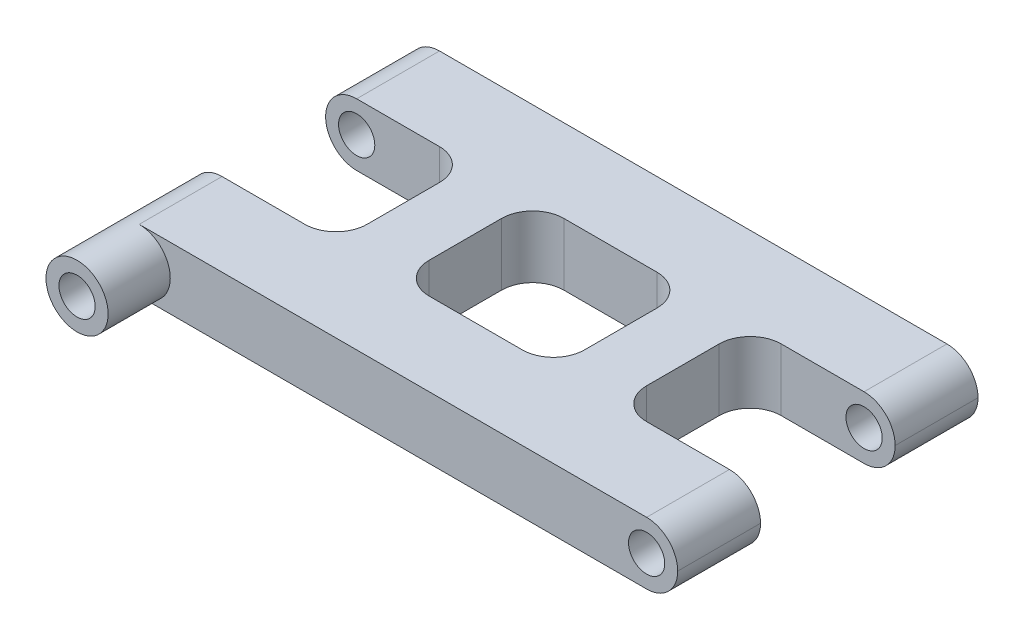
ISO-10303-21;
HEADER;
FILE_DESCRIPTION(('STEP AP214'),'2;1');
FILE_NAME('part.step','',(''),(''),'','','');
FILE_SCHEMA(('AUTOMOTIVE_DESIGN { 1 0 10303 214 1 1 1 1 }'));
ENDSEC;
DATA;
#1=APPLICATION_CONTEXT('core data for automotive mechanical design processes');
#2=APPLICATION_PROTOCOL_DEFINITION('international standard','automotive_design',2000,#1);
#3=PRODUCT_CONTEXT('',#1,'mechanical');
#4=PRODUCT('Part','Part','',(#3));
#5=PRODUCT_RELATED_PRODUCT_CATEGORY('part','',(#4));
#6=PRODUCT_DEFINITION_FORMATION('','',#4);
#7=PRODUCT_DEFINITION_CONTEXT('part definition',#1,'design');
#8=PRODUCT_DEFINITION('design','',#6,#7);
#9=PRODUCT_DEFINITION_SHAPE('','',#8);
#10=(LENGTH_UNIT() NAMED_UNIT(*) SI_UNIT(.MILLI.,.METRE.));
#11=(NAMED_UNIT(*) PLANE_ANGLE_UNIT() SI_UNIT($,.RADIAN.));
#12=(NAMED_UNIT(*) SI_UNIT($,.STERADIAN.) SOLID_ANGLE_UNIT());
#13=UNCERTAINTY_MEASURE_WITH_UNIT(LENGTH_MEASURE(1.E-05),#10,'distance_accuracy_value','');
#14=(GEOMETRIC_REPRESENTATION_CONTEXT(3) GLOBAL_UNCERTAINTY_ASSIGNED_CONTEXT((#13)) GLOBAL_UNIT_ASSIGNED_CONTEXT((#10,
#11,#12)) REPRESENTATION_CONTEXT('',''));
#15=CARTESIAN_POINT('',(0.,0.,0.));
#16=DIRECTION('',(0.,0.,1.));
#17=DIRECTION('',(1.,0.,0.));
#18=AXIS2_PLACEMENT_3D('',#15,#16,#17);
#19=CARTESIAN_POINT('',(0.,3.,0.));
#20=DIRECTION('',(0.,1.,0.));
#21=DIRECTION('',(0.,0.,1.));
#22=AXIS2_PLACEMENT_3D('',#19,#20,#21);
#23=PLANE('',#22);
#24=DIRECTION('',(0.,0.,-1.));
#25=VECTOR('',#24,1.);
#26=CARTESIAN_POINT('',(41.,3.,-21.));
#27=LINE('',#26,#25);
#28=CARTESIAN_POINT('',(41.,3.,-11.));
#29=VERTEX_POINT('',#28);
#30=CARTESIAN_POINT('',(41.,3.,-18.));
#31=VERTEX_POINT('',#30);
#32=EDGE_CURVE('E291',#29,#31,#27,.T.);
#33=ORIENTED_EDGE('',*,*,#32,.T.);
#34=CARTESIAN_POINT('',(44.,3.,-18.));
#35=DIRECTION('',(0.,1.,0.));
#36=DIRECTION('',(0.,0.,1.));
#37=AXIS2_PLACEMENT_3D('',#34,#35,#36);
#38=CIRCLE('',#37,3.);
#39=CARTESIAN_POINT('',(44.,3.,-21.));
#40=VERTEX_POINT('',#39);
#41=EDGE_CURVE('E60',#31,#40,#38,.F.);
#42=ORIENTED_EDGE('',*,*,#41,.T.);
#43=DIRECTION('',(1.,0.,0.));
#44=VECTOR('',#43,1.);
#45=CARTESIAN_POINT('',(55.,3.,-21.));
#46=LINE('',#45,#44);
#47=CARTESIAN_POINT('',(52.,3.,-21.));
#48=VERTEX_POINT('',#47);
#49=EDGE_CURVE('E293',#40,#48,#46,.T.);
#50=ORIENTED_EDGE('',*,*,#49,.T.);
#51=DIRECTION('',(0.,0.,-1.));
#52=VECTOR('',#51,1.);
#53=CARTESIAN_POINT('',(52.,3.,-29.));
#54=LINE('',#53,#52);
#55=CARTESIAN_POINT('',(52.,3.,-29.));
#56=VERTEX_POINT('',#55);
#57=EDGE_CURVE('E326',#48,#56,#54,.T.);
#58=ORIENTED_EDGE('',*,*,#57,.T.);
#59=DIRECTION('',(-1.,0.,0.));
#60=VECTOR('',#59,1.);
#61=CARTESIAN_POINT('',(0.,3.,-29.));
#62=LINE('',#61,#60);
#63=CARTESIAN_POINT('',(2.99999999999999,3.,-29.));
#64=VERTEX_POINT('',#63);
#65=EDGE_CURVE('E295',#56,#64,#62,.T.);
#66=ORIENTED_EDGE('',*,*,#65,.T.);
#67=DIRECTION('',(0.,0.,1.));
#68=VECTOR('',#67,1.);
#69=CARTESIAN_POINT('',(2.99999999999999,3.,-21.));
#70=LINE('',#69,#68);
#71=CARTESIAN_POINT('',(3.,3.,-21.));
#72=VERTEX_POINT('',#71);
#73=EDGE_CURVE('E244',#64,#72,#70,.T.);
#74=ORIENTED_EDGE('',*,*,#73,.T.);
#75=DIRECTION('',(1.,0.,0.));
#76=VECTOR('',#75,1.);
#77=CARTESIAN_POINT('',(14.,3.,-21.));
#78=LINE('',#77,#76);
#79=CARTESIAN_POINT('',(11.,3.,-21.));
#80=VERTEX_POINT('',#79);
#81=EDGE_CURVE('E298',#72,#80,#78,.T.);
#82=ORIENTED_EDGE('',*,*,#81,.T.);
#83=CARTESIAN_POINT('',(11.,3.,-18.));
#84=DIRECTION('',(0.,1.,0.));
#85=DIRECTION('',(0.,0.,1.));
#86=AXIS2_PLACEMENT_3D('',#83,#84,#85);
#87=CIRCLE('',#86,3.);
#88=CARTESIAN_POINT('',(14.,3.,-18.));
#89=VERTEX_POINT('',#88);
#90=EDGE_CURVE('E418',#80,#89,#87,.F.);
#91=ORIENTED_EDGE('',*,*,#90,.T.);
#92=DIRECTION('',(0.,0.,1.));
#93=VECTOR('',#92,1.);
#94=CARTESIAN_POINT('',(14.,3.,-8.));
#95=LINE('',#94,#93);
#96=CARTESIAN_POINT('',(14.,3.,-11.));
#97=VERTEX_POINT('',#96);
#98=EDGE_CURVE('E301',#89,#97,#95,.T.);
#99=ORIENTED_EDGE('',*,*,#98,.T.);
#100=CARTESIAN_POINT('',(11.,3.,-11.));
#101=DIRECTION('',(0.,1.,0.));
#102=DIRECTION('',(0.,0.,1.));
#103=AXIS2_PLACEMENT_3D('',#100,#101,#102);
#104=CIRCLE('',#103,3.);
#105=CARTESIAN_POINT('',(11.,3.,-8.));
#106=VERTEX_POINT('',#105);
#107=EDGE_CURVE('E426',#97,#106,#104,.F.);
#108=ORIENTED_EDGE('',*,*,#107,.T.);
#109=DIRECTION('',(-1.,0.,0.));
#110=VECTOR('',#109,1.);
#111=CARTESIAN_POINT('',(0.,3.,-8.));
#112=LINE('',#111,#110);
#113=CARTESIAN_POINT('',(3.,3.,-8.));
#114=VERTEX_POINT('',#113);
#115=EDGE_CURVE('E239',#106,#114,#112,.T.);
#116=ORIENTED_EDGE('',*,*,#115,.T.);
#117=DIRECTION('',(0.,0.,1.));
#118=VECTOR('',#117,1.);
#119=CARTESIAN_POINT('',(3.,3.,0.));
#120=LINE('',#119,#118);
#121=CARTESIAN_POINT('',(3.00000000000007,3.00000000000041,0.));
#122=VERTEX_POINT('',#121);
#123=EDGE_CURVE('E236',#114,#122,#120,.T.);
#124=ORIENTED_EDGE('',*,*,#123,.T.);
#125=DIRECTION('',(1.,0.,0.));
#126=VECTOR('',#125,1.);
#127=CARTESIAN_POINT('',(0.,3.,0.));
#128=LINE('',#127,#126);
#129=CARTESIAN_POINT('',(52.,3.,0.));
#130=VERTEX_POINT('',#129);
#131=EDGE_CURVE('E222',#122,#130,#128,.T.);
#132=ORIENTED_EDGE('',*,*,#131,.T.);
#133=DIRECTION('',(0.,0.,-1.));
#134=VECTOR('',#133,1.);
#135=CARTESIAN_POINT('',(52.,3.,-8.));
#136=LINE('',#135,#134);
#137=CARTESIAN_POINT('',(52.,3.,-8.));
#138=VERTEX_POINT('',#137);
#139=EDGE_CURVE('E243',#130,#138,#136,.T.);
#140=ORIENTED_EDGE('',*,*,#139,.T.);
#141=DIRECTION('',(-1.,0.,0.));
#142=VECTOR('',#141,1.);
#143=CARTESIAN_POINT('',(55.,3.,-8.));
#144=LINE('',#143,#142);
#145=CARTESIAN_POINT('',(44.,3.,-8.));
#146=VERTEX_POINT('',#145);
#147=EDGE_CURVE('E232',#138,#146,#144,.T.);
#148=ORIENTED_EDGE('',*,*,#147,.T.);
#149=CARTESIAN_POINT('',(44.,3.,-11.));
#150=DIRECTION('',(0.,1.,0.));
#151=DIRECTION('',(0.,0.,1.));
#152=AXIS2_PLACEMENT_3D('',#149,#150,#151);
#153=CIRCLE('',#152,3.);
#154=EDGE_CURVE('E438',#146,#29,#153,.F.);
#155=ORIENTED_EDGE('',*,*,#154,.T.);
#156=EDGE_LOOP('',(#33,#42,#50,#58,#66,#74,#82,#91,#99,#108,#116,#124,#132,#140,#148,#155));
#157=FACE_BOUND('',#156,.T.);
#158=DIRECTION('',(1.,0.,0.));
#159=VECTOR('',#158,1.);
#160=CARTESIAN_POINT('',(20.,3.,-8.));
#161=LINE('',#160,#159);
#162=CARTESIAN_POINT('',(23.,3.,-8.));
#163=VERTEX_POINT('',#162);
#164=CARTESIAN_POINT('',(32.,3.,-8.));
#165=VERTEX_POINT('',#164);
#166=EDGE_CURVE('E266',#163,#165,#161,.T.);
#167=ORIENTED_EDGE('',*,*,#166,.F.);
#168=CARTESIAN_POINT('',(23.,3.,-11.));
#169=DIRECTION('',(0.,1.,0.));
#170=DIRECTION('',(0.,0.,1.));
#171=AXIS2_PLACEMENT_3D('',#168,#169,#170);
#172=CIRCLE('',#171,3.);
#173=CARTESIAN_POINT('',(20.,3.,-11.));
#174=VERTEX_POINT('',#173);
#175=EDGE_CURVE('E434',#163,#174,#172,.F.);
#176=ORIENTED_EDGE('',*,*,#175,.T.);
#177=DIRECTION('',(0.,0.,1.));
#178=VECTOR('',#177,1.);
#179=CARTESIAN_POINT('',(20.,3.,-8.));
#180=LINE('',#179,#178);
#181=CARTESIAN_POINT('',(20.,3.,-18.));
#182=VERTEX_POINT('',#181);
#183=EDGE_CURVE('E263',#182,#174,#180,.T.);
#184=ORIENTED_EDGE('',*,*,#183,.F.);
#185=CARTESIAN_POINT('',(23.,3.,-18.));
#186=DIRECTION('',(0.,1.,0.));
#187=DIRECTION('',(0.,0.,1.));
#188=AXIS2_PLACEMENT_3D('',#185,#186,#187);
#189=CIRCLE('',#188,3.);
#190=CARTESIAN_POINT('',(23.,3.,-21.));
#191=VERTEX_POINT('',#190);
#192=EDGE_CURVE('E11',#182,#191,#189,.F.);
#193=ORIENTED_EDGE('',*,*,#192,.T.);
#194=DIRECTION('',(-1.,0.,0.));
#195=VECTOR('',#194,1.);
#196=CARTESIAN_POINT('',(20.,3.,-21.));
#197=LINE('',#196,#195);
#198=CARTESIAN_POINT('',(32.,3.,-21.));
#199=VERTEX_POINT('',#198);
#200=EDGE_CURVE('E273',#199,#191,#197,.T.);
#201=ORIENTED_EDGE('',*,*,#200,.F.);
#202=CARTESIAN_POINT('',(32.,3.,-18.));
#203=DIRECTION('',(0.,1.,0.));
#204=DIRECTION('',(0.,0.,1.));
#205=AXIS2_PLACEMENT_3D('',#202,#203,#204);
#206=CIRCLE('',#205,3.);
#207=CARTESIAN_POINT('',(35.,3.,-18.));
#208=VERTEX_POINT('',#207);
#209=EDGE_CURVE('E422',#199,#208,#206,.F.);
#210=ORIENTED_EDGE('',*,*,#209,.T.);
#211=DIRECTION('',(0.,0.,-1.));
#212=VECTOR('',#211,1.);
#213=CARTESIAN_POINT('',(35.,3.,-8.));
#214=LINE('',#213,#212);
#215=CARTESIAN_POINT('',(35.,3.,-11.));
#216=VERTEX_POINT('',#215);
#217=EDGE_CURVE('E270',#216,#208,#214,.T.);
#218=ORIENTED_EDGE('',*,*,#217,.F.);
#219=CARTESIAN_POINT('',(32.,3.,-11.));
#220=DIRECTION('',(0.,1.,0.));
#221=DIRECTION('',(0.,0.,1.));
#222=AXIS2_PLACEMENT_3D('',#219,#220,#221);
#223=CIRCLE('',#222,3.);
#224=EDGE_CURVE('E430',#216,#165,#223,.F.);
#225=ORIENTED_EDGE('',*,*,#224,.T.);
#226=EDGE_LOOP('',(#167,#176,#184,#193,#201,#210,#218,#225));
#227=FACE_BOUND('',#226,.T.);
#228=ADVANCED_FACE('F37',(#157,#227),#23,.T.);
#229=CARTESIAN_POINT('',(0.,-3.,0.));
#230=DIRECTION('',(0.,1.,0.));
#231=DIRECTION('',(0.,0.,1.));
#232=AXIS2_PLACEMENT_3D('',#229,#230,#231);
#233=PLANE('',#232);
#234=DIRECTION('',(-1.,0.,0.));
#235=VECTOR('',#234,1.);
#236=CARTESIAN_POINT('',(0.,-3.,-29.));
#237=LINE('',#236,#235);
#238=CARTESIAN_POINT('',(52.,-3.,-29.));
#239=VERTEX_POINT('',#238);
#240=CARTESIAN_POINT('',(2.99999999999999,-3.,-29.));
#241=VERTEX_POINT('',#240);
#242=EDGE_CURVE('E314',#239,#241,#237,.T.);
#243=ORIENTED_EDGE('',*,*,#242,.F.);
#244=DIRECTION('',(0.,0.,-1.));
#245=VECTOR('',#244,1.);
#246=CARTESIAN_POINT('',(52.,-3.,0.));
#247=LINE('',#246,#245);
#248=CARTESIAN_POINT('',(52.,-3.,-21.));
#249=VERTEX_POINT('',#248);
#250=EDGE_CURVE('E349',#239,#249,#247,.F.);
#251=ORIENTED_EDGE('',*,*,#250,.T.);
#252=DIRECTION('',(1.,0.,0.));
#253=VECTOR('',#252,1.);
#254=CARTESIAN_POINT('',(55.,-3.,-21.));
#255=LINE('',#254,#253);
#256=CARTESIAN_POINT('',(44.,-3.,-21.));
#257=VERTEX_POINT('',#256);
#258=EDGE_CURVE('E312',#257,#249,#255,.T.);
#259=ORIENTED_EDGE('',*,*,#258,.F.);
#260=CARTESIAN_POINT('',(44.,-3.,-18.));
#261=DIRECTION('',(0.,1.,0.));
#262=DIRECTION('',(0.,0.,1.));
#263=AXIS2_PLACEMENT_3D('',#260,#261,#262);
#264=CIRCLE('',#263,3.);
#265=CARTESIAN_POINT('',(41.,-3.,-18.));
#266=VERTEX_POINT('',#265);
#267=EDGE_CURVE('E52',#257,#266,#264,.T.);
#268=ORIENTED_EDGE('',*,*,#267,.T.);
#269=DIRECTION('',(0.,0.,-1.));
#270=VECTOR('',#269,1.);
#271=CARTESIAN_POINT('',(41.,-3.,-21.));
#272=LINE('',#271,#270);
#273=CARTESIAN_POINT('',(41.,-3.,-11.));
#274=VERTEX_POINT('',#273);
#275=EDGE_CURVE('E309',#274,#266,#272,.T.);
#276=ORIENTED_EDGE('',*,*,#275,.F.);
#277=CARTESIAN_POINT('',(44.,-3.,-11.));
#278=DIRECTION('',(0.,1.,0.));
#279=DIRECTION('',(0.,0.,1.));
#280=AXIS2_PLACEMENT_3D('',#277,#278,#279);
#281=CIRCLE('',#280,3.);
#282=CARTESIAN_POINT('',(44.,-3.,-8.));
#283=VERTEX_POINT('',#282);
#284=EDGE_CURVE('E436',#274,#283,#281,.T.);
#285=ORIENTED_EDGE('',*,*,#284,.T.);
#286=DIRECTION('',(-1.,0.,0.));
#287=VECTOR('',#286,1.);
#288=CARTESIAN_POINT('',(55.,-3.,-8.));
#289=LINE('',#288,#287);
#290=CARTESIAN_POINT('',(52.,-3.,-8.));
#291=VERTEX_POINT('',#290);
#292=EDGE_CURVE('E306',#291,#283,#289,.T.);
#293=ORIENTED_EDGE('',*,*,#292,.F.);
#294=DIRECTION('',(0.,0.,-1.));
#295=VECTOR('',#294,1.);
#296=CARTESIAN_POINT('',(52.,-3.,0.));
#297=LINE('',#296,#295);
#298=CARTESIAN_POINT('',(52.,-3.,0.));
#299=VERTEX_POINT('',#298);
#300=EDGE_CURVE('E346',#291,#299,#297,.F.);
#301=ORIENTED_EDGE('',*,*,#300,.T.);
#302=DIRECTION('',(1.,0.,0.));
#303=VECTOR('',#302,1.);
#304=CARTESIAN_POINT('',(0.,-3.,0.));
#305=LINE('',#304,#303);
#306=CARTESIAN_POINT('',(3.,-3.,0.));
#307=VERTEX_POINT('',#306);
#308=EDGE_CURVE('E276',#307,#299,#305,.T.);
#309=ORIENTED_EDGE('',*,*,#308,.F.);
#310=DIRECTION('',(0.,0.,1.));
#311=VECTOR('',#310,1.);
#312=CARTESIAN_POINT('',(3.,-3.,0.));
#313=LINE('',#312,#311);
#314=CARTESIAN_POINT('',(3.,-3.,-8.));
#315=VERTEX_POINT('',#314);
#316=EDGE_CURVE('E251',#307,#315,#313,.F.);
#317=ORIENTED_EDGE('',*,*,#316,.T.);
#318=DIRECTION('',(-1.,0.,0.));
#319=VECTOR('',#318,1.);
#320=CARTESIAN_POINT('',(0.,-3.,-8.));
#321=LINE('',#320,#319);
#322=CARTESIAN_POINT('',(11.,-3.,-8.));
#323=VERTEX_POINT('',#322);
#324=EDGE_CURVE('E233',#323,#315,#321,.T.);
#325=ORIENTED_EDGE('',*,*,#324,.F.);
#326=CARTESIAN_POINT('',(11.,-3.,-11.));
#327=DIRECTION('',(0.,1.,0.));
#328=DIRECTION('',(0.,0.,1.));
#329=AXIS2_PLACEMENT_3D('',#326,#327,#328);
#330=CIRCLE('',#329,3.);
#331=CARTESIAN_POINT('',(14.,-3.,-11.));
#332=VERTEX_POINT('',#331);
#333=EDGE_CURVE('E424',#323,#332,#330,.T.);
#334=ORIENTED_EDGE('',*,*,#333,.T.);
#335=DIRECTION('',(0.,0.,1.));
#336=VECTOR('',#335,1.);
#337=CARTESIAN_POINT('',(14.,-3.,-8.));
#338=LINE('',#337,#336);
#339=CARTESIAN_POINT('',(14.,-3.,-18.));
#340=VERTEX_POINT('',#339);
#341=EDGE_CURVE('E320',#340,#332,#338,.T.);
#342=ORIENTED_EDGE('',*,*,#341,.F.);
#343=CARTESIAN_POINT('',(11.,-3.,-18.));
#344=DIRECTION('',(0.,1.,0.));
#345=DIRECTION('',(0.,0.,1.));
#346=AXIS2_PLACEMENT_3D('',#343,#344,#345);
#347=CIRCLE('',#346,3.);
#348=CARTESIAN_POINT('',(11.,-3.,-21.));
#349=VERTEX_POINT('',#348);
#350=EDGE_CURVE('E416',#340,#349,#347,.T.);
#351=ORIENTED_EDGE('',*,*,#350,.T.);
#352=DIRECTION('',(1.,0.,0.));
#353=VECTOR('',#352,1.);
#354=CARTESIAN_POINT('',(14.,-3.,-21.));
#355=LINE('',#354,#353);
#356=CARTESIAN_POINT('',(3.,-3.,-21.));
#357=VERTEX_POINT('',#356);
#358=EDGE_CURVE('E317',#357,#349,#355,.T.);
#359=ORIENTED_EDGE('',*,*,#358,.F.);
#360=DIRECTION('',(0.,0.,1.));
#361=VECTOR('',#360,1.);
#362=CARTESIAN_POINT('',(2.99999999999999,-3.,0.));
#363=LINE('',#362,#361);
#364=EDGE_CURVE('E342',#357,#241,#363,.F.);
#365=ORIENTED_EDGE('',*,*,#364,.T.);
#366=EDGE_LOOP('',(#243,#251,#259,#268,#276,#285,#293,#301,#309,#317,#325,#334,#342,#351,#359,#365));
#367=FACE_BOUND('',#366,.T.);
#368=DIRECTION('',(-1.,0.,0.));
#369=VECTOR('',#368,1.);
#370=CARTESIAN_POINT('',(20.,-3.,-21.));
#371=LINE('',#370,#369);
#372=CARTESIAN_POINT('',(32.,-3.,-21.));
#373=VERTEX_POINT('',#372);
#374=CARTESIAN_POINT('',(23.,-3.,-21.));
#375=VERTEX_POINT('',#374);
#376=EDGE_CURVE('E267',#373,#375,#371,.T.);
#377=ORIENTED_EDGE('',*,*,#376,.T.);
#378=CARTESIAN_POINT('',(23.,-3.,-18.));
#379=DIRECTION('',(0.,1.,0.));
#380=DIRECTION('',(0.,0.,1.));
#381=AXIS2_PLACEMENT_3D('',#378,#379,#380);
#382=CIRCLE('',#381,3.);
#383=CARTESIAN_POINT('',(20.,-3.,-18.));
#384=VERTEX_POINT('',#383);
#385=EDGE_CURVE('E45',#375,#384,#382,.T.);
#386=ORIENTED_EDGE('',*,*,#385,.T.);
#387=DIRECTION('',(0.,0.,1.));
#388=VECTOR('',#387,1.);
#389=CARTESIAN_POINT('',(20.,-3.,-8.));
#390=LINE('',#389,#388);
#391=CARTESIAN_POINT('',(20.,-3.,-11.));
#392=VERTEX_POINT('',#391);
#393=EDGE_CURVE('E277',#384,#392,#390,.T.);
#394=ORIENTED_EDGE('',*,*,#393,.T.);
#395=CARTESIAN_POINT('',(23.,-3.,-11.));
#396=DIRECTION('',(0.,1.,0.));
#397=DIRECTION('',(0.,0.,1.));
#398=AXIS2_PLACEMENT_3D('',#395,#396,#397);
#399=CIRCLE('',#398,3.);
#400=CARTESIAN_POINT('',(23.,-3.,-8.));
#401=VERTEX_POINT('',#400);
#402=EDGE_CURVE('E432',#392,#401,#399,.T.);
#403=ORIENTED_EDGE('',*,*,#402,.T.);
#404=DIRECTION('',(1.,0.,0.));
#405=VECTOR('',#404,1.);
#406=CARTESIAN_POINT('',(20.,-3.,-8.));
#407=LINE('',#406,#405);
#408=CARTESIAN_POINT('',(32.,-3.,-8.));
#409=VERTEX_POINT('',#408);
#410=EDGE_CURVE('E280',#401,#409,#407,.T.);
#411=ORIENTED_EDGE('',*,*,#410,.T.);
#412=CARTESIAN_POINT('',(32.,-3.,-11.));
#413=DIRECTION('',(0.,1.,0.));
#414=DIRECTION('',(0.,0.,1.));
#415=AXIS2_PLACEMENT_3D('',#412,#413,#414);
#416=CIRCLE('',#415,3.);
#417=CARTESIAN_POINT('',(35.,-3.,-11.));
#418=VERTEX_POINT('',#417);
#419=EDGE_CURVE('E428',#409,#418,#416,.T.);
#420=ORIENTED_EDGE('',*,*,#419,.T.);
#421=DIRECTION('',(0.,0.,-1.));
#422=VECTOR('',#421,1.);
#423=CARTESIAN_POINT('',(35.,-3.,-8.));
#424=LINE('',#423,#422);
#425=CARTESIAN_POINT('',(35.,-3.,-18.));
#426=VERTEX_POINT('',#425);
#427=EDGE_CURVE('E284',#418,#426,#424,.T.);
#428=ORIENTED_EDGE('',*,*,#427,.T.);
#429=CARTESIAN_POINT('',(32.,-3.,-18.));
#430=DIRECTION('',(0.,1.,0.));
#431=DIRECTION('',(0.,0.,1.));
#432=AXIS2_PLACEMENT_3D('',#429,#430,#431);
#433=CIRCLE('',#432,3.);
#434=EDGE_CURVE('E420',#426,#373,#433,.T.);
#435=ORIENTED_EDGE('',*,*,#434,.T.);
#436=EDGE_LOOP('',(#377,#386,#394,#403,#411,#420,#428,#435));
#437=FACE_BOUND('',#436,.T.);
#438=ADVANCED_FACE('F443',(#367,#437),#233,.F.);
#439=CARTESIAN_POINT('',(0.,3.,0.));
#440=DIRECTION('',(0.,0.,-1.));
#441=DIRECTION('',(-1.,0.,0.));
#442=AXIS2_PLACEMENT_3D('',#439,#440,#441);
#443=PLANE('',#442);
#444=CARTESIAN_POINT('',(52.,0.,0.));
#445=DIRECTION('',(0.,0.,1.));
#446=DIRECTION('',(1.,0.,0.));
#447=AXIS2_PLACEMENT_3D('',#444,#445,#446);
#448=CIRCLE('',#447,1.75);
#449=CARTESIAN_POINT('',(53.75,0.,0.));
#450=VERTEX_POINT('',#449);
#451=EDGE_CURVE('E926',#450,#450,#448,.T.);
#452=ORIENTED_EDGE('',*,*,#451,.F.);
#453=EDGE_LOOP('',(#452));
#454=FACE_BOUND('',#453,.T.);
#455=CARTESIAN_POINT('',(3.00000000000007,4.1286418728248E-13,0.));
#456=DIRECTION('',(0.,0.,1.));
#457=DIRECTION('',(1.,0.,0.));
#458=AXIS2_PLACEMENT_3D('',#455,#456,#457);
#459=CIRCLE('',#458,3.);
#460=EDGE_CURVE('E227',#307,#122,#459,.T.);
#461=ORIENTED_EDGE('',*,*,#460,.F.);
#462=ORIENTED_EDGE('',*,*,#308,.T.);
#463=CARTESIAN_POINT('',(52.,0.,0.));
#464=DIRECTION('',(0.,0.,-1.));
#465=DIRECTION('',(-1.,0.,0.));
#466=AXIS2_PLACEMENT_3D('',#463,#464,#465);
#467=CIRCLE('',#466,3.);
#468=CARTESIAN_POINT('',(55.,0.,0.));
#469=VERTEX_POINT('',#468);
#470=EDGE_CURVE('E357',#299,#469,#467,.F.);
#471=ORIENTED_EDGE('',*,*,#470,.T.);
#472=CARTESIAN_POINT('',(52.,0.,0.));
#473=DIRECTION('',(0.,0.,-1.));
#474=DIRECTION('',(-1.,0.,0.));
#475=AXIS2_PLACEMENT_3D('',#472,#473,#474);
#476=CIRCLE('',#475,3.);
#477=EDGE_CURVE('E230',#469,#130,#476,.F.);
#478=ORIENTED_EDGE('',*,*,#477,.T.);
#479=ORIENTED_EDGE('',*,*,#131,.F.);
#480=EDGE_LOOP('',(#461,#462,#471,#478,#479));
#481=FACE_BOUND('',#480,.T.);
#482=ADVANCED_FACE('F224',(#454,#481),#443,.F.);
#483=CARTESIAN_POINT('',(55.,3.,-8.));
#484=DIRECTION('',(0.,0.,1.));
#485=DIRECTION('',(1.,0.,0.));
#486=AXIS2_PLACEMENT_3D('',#483,#484,#485);
#487=PLANE('',#486);
#488=CARTESIAN_POINT('',(52.,0.,-8.));
#489=DIRECTION('',(0.,0.,1.));
#490=DIRECTION('',(1.,0.,0.));
#491=AXIS2_PLACEMENT_3D('',#488,#489,#490);
#492=CIRCLE('',#491,1.75);
#493=CARTESIAN_POINT('',(53.75,0.,-8.));
#494=VERTEX_POINT('',#493);
#495=EDGE_CURVE('E919',#494,#494,#492,.T.);
#496=ORIENTED_EDGE('',*,*,#495,.T.);
#497=EDGE_LOOP('',(#496));
#498=FACE_BOUND('',#497,.T.);
#499=ORIENTED_EDGE('',*,*,#292,.T.);
#500=DIRECTION('',(0.,-1.,0.));
#501=VECTOR('',#500,1.);
#502=CARTESIAN_POINT('',(44.,3.,-8.));
#503=LINE('',#502,#501);
#504=EDGE_CURVE('E412',#283,#146,#503,.F.);
#505=ORIENTED_EDGE('',*,*,#504,.T.);
#506=ORIENTED_EDGE('',*,*,#147,.F.);
#507=CARTESIAN_POINT('',(52.,0.,-8.));
#508=DIRECTION('',(0.,0.,1.));
#509=DIRECTION('',(1.,0.,0.));
#510=AXIS2_PLACEMENT_3D('',#507,#508,#509);
#511=CIRCLE('',#510,3.);
#512=CARTESIAN_POINT('',(55.,0.,-8.));
#513=VERTEX_POINT('',#512);
#514=EDGE_CURVE('E352',#138,#513,#511,.F.);
#515=ORIENTED_EDGE('',*,*,#514,.T.);
#516=CARTESIAN_POINT('',(52.,0.,-8.));
#517=DIRECTION('',(0.,0.,1.));
#518=DIRECTION('',(1.,0.,0.));
#519=AXIS2_PLACEMENT_3D('',#516,#517,#518);
#520=CIRCLE('',#519,3.);
#521=EDGE_CURVE('E354',#513,#291,#520,.F.);
#522=ORIENTED_EDGE('',*,*,#521,.T.);
#523=EDGE_LOOP('',(#499,#505,#506,#515,#522));
#524=FACE_BOUND('',#523,.T.);
#525=ADVANCED_FACE('F523',(#498,#524),#487,.F.);
#526=CARTESIAN_POINT('',(41.,3.,-21.));
#527=DIRECTION('',(-1.,0.,0.));
#528=DIRECTION('',(0.,0.,1.));
#529=AXIS2_PLACEMENT_3D('',#526,#527,#528);
#530=PLANE('',#529);
#531=ORIENTED_EDGE('',*,*,#32,.F.);
#532=DIRECTION('',(0.,-1.,0.));
#533=VECTOR('',#532,1.);
#534=CARTESIAN_POINT('',(41.,-3.,-11.));
#535=LINE('',#534,#533);
#536=EDGE_CURVE('E409',#29,#274,#535,.T.);
#537=ORIENTED_EDGE('',*,*,#536,.T.);
#538=ORIENTED_EDGE('',*,*,#275,.T.);
#539=DIRECTION('',(0.,-1.,0.));
#540=VECTOR('',#539,1.);
#541=CARTESIAN_POINT('',(41.,3.,-18.));
#542=LINE('',#541,#540);
#543=EDGE_CURVE('E407',#266,#31,#542,.F.);
#544=ORIENTED_EDGE('',*,*,#543,.T.);
#545=EDGE_LOOP('',(#531,#537,#538,#544));
#546=FACE_BOUND('',#545,.T.);
#547=ADVANCED_FACE('F519',(#546),#530,.F.);
#548=CARTESIAN_POINT('',(55.,3.,-21.));
#549=DIRECTION('',(0.,0.,-1.));
#550=DIRECTION('',(-1.,0.,0.));
#551=AXIS2_PLACEMENT_3D('',#548,#549,#550);
#552=PLANE('',#551);
#553=CARTESIAN_POINT('',(52.,0.,-21.));
#554=DIRECTION('',(0.,0.,-1.));
#555=DIRECTION('',(-1.,0.,0.));
#556=AXIS2_PLACEMENT_3D('',#553,#554,#555);
#557=CIRCLE('',#556,1.75);
#558=CARTESIAN_POINT('',(50.25,0.,-21.));
#559=VERTEX_POINT('',#558);
#560=EDGE_CURVE('E922',#559,#559,#557,.T.);
#561=ORIENTED_EDGE('',*,*,#560,.T.);
#562=EDGE_LOOP('',(#561));
#563=FACE_BOUND('',#562,.T.);
#564=ORIENTED_EDGE('',*,*,#49,.F.);
#565=DIRECTION('',(0.,-1.,0.));
#566=VECTOR('',#565,1.);
#567=CARTESIAN_POINT('',(44.,-3.,-21.));
#568=LINE('',#567,#566);
#569=EDGE_CURVE('E414',#40,#257,#568,.T.);
#570=ORIENTED_EDGE('',*,*,#569,.T.);
#571=ORIENTED_EDGE('',*,*,#258,.T.);
#572=CARTESIAN_POINT('',(52.,0.,-21.));
#573=DIRECTION('',(0.,0.,-1.));
#574=DIRECTION('',(-1.,0.,0.));
#575=AXIS2_PLACEMENT_3D('',#572,#573,#574);
#576=CIRCLE('',#575,3.);
#577=CARTESIAN_POINT('',(55.,0.,-21.));
#578=VERTEX_POINT('',#577);
#579=EDGE_CURVE('E337',#249,#578,#576,.F.);
#580=ORIENTED_EDGE('',*,*,#579,.T.);
#581=CARTESIAN_POINT('',(52.,0.,-21.));
#582=DIRECTION('',(0.,0.,-1.));
#583=DIRECTION('',(-1.,0.,0.));
#584=AXIS2_PLACEMENT_3D('',#581,#582,#583);
#585=CIRCLE('',#584,3.);
#586=EDGE_CURVE('E339',#578,#48,#585,.F.);
#587=ORIENTED_EDGE('',*,*,#586,.T.);
#588=EDGE_LOOP('',(#564,#570,#571,#580,#587));
#589=FACE_BOUND('',#588,.T.);
#590=ADVANCED_FACE('F515',(#563,#589),#552,.F.);
#591=CARTESIAN_POINT('',(0.,3.,-29.));
#592=DIRECTION('',(0.,0.,1.));
#593=DIRECTION('',(1.,0.,0.));
#594=AXIS2_PLACEMENT_3D('',#591,#592,#593);
#595=PLANE('',#594);
#596=CARTESIAN_POINT('',(52.,0.,-29.));
#597=DIRECTION('',(0.,0.,1.));
#598=DIRECTION('',(1.,0.,0.));
#599=AXIS2_PLACEMENT_3D('',#596,#597,#598);
#600=CIRCLE('',#599,1.75);
#601=CARTESIAN_POINT('',(53.75,0.,-29.));
#602=VERTEX_POINT('',#601);
#603=EDGE_CURVE('E925',#602,#602,#600,.T.);
#604=ORIENTED_EDGE('',*,*,#603,.T.);
#605=EDGE_LOOP('',(#604));
#606=FACE_BOUND('',#605,.T.);
#607=CARTESIAN_POINT('',(3.,0.,-29.));
#608=DIRECTION('',(0.,0.,1.));
#609=DIRECTION('',(1.,0.,0.));
#610=AXIS2_PLACEMENT_3D('',#607,#608,#609);
#611=CIRCLE('',#610,1.75);
#612=CARTESIAN_POINT('',(4.75,0.,-29.));
#613=VERTEX_POINT('',#612);
#614=EDGE_CURVE('E378',#613,#613,#611,.T.);
#615=ORIENTED_EDGE('',*,*,#614,.T.);
#616=EDGE_LOOP('',(#615));
#617=FACE_BOUND('',#616,.T.);
#618=ORIENTED_EDGE('',*,*,#65,.F.);
#619=CARTESIAN_POINT('',(52.,0.,-29.));
#620=DIRECTION('',(0.,0.,1.));
#621=DIRECTION('',(1.,0.,0.));
#622=AXIS2_PLACEMENT_3D('',#619,#620,#621);
#623=CIRCLE('',#622,3.);
#624=CARTESIAN_POINT('',(55.,0.,-29.));
#625=VERTEX_POINT('',#624);
#626=EDGE_CURVE('E335',#56,#625,#623,.F.);
#627=ORIENTED_EDGE('',*,*,#626,.T.);
#628=CARTESIAN_POINT('',(52.,0.,-29.));
#629=DIRECTION('',(0.,0.,1.));
#630=DIRECTION('',(1.,0.,0.));
#631=AXIS2_PLACEMENT_3D('',#628,#629,#630);
#632=CIRCLE('',#631,3.);
#633=EDGE_CURVE('E333',#625,#239,#632,.F.);
#634=ORIENTED_EDGE('',*,*,#633,.T.);
#635=ORIENTED_EDGE('',*,*,#242,.T.);
#636=CARTESIAN_POINT('',(2.99999999999999,0.,-29.));
#637=DIRECTION('',(0.,0.,1.));
#638=DIRECTION('',(1.,0.,0.));
#639=AXIS2_PLACEMENT_3D('',#636,#637,#638);
#640=CIRCLE('',#639,3.);
#641=CARTESIAN_POINT('',(0.,0.,-29.));
#642=VERTEX_POINT('',#641);
#643=EDGE_CURVE('E331',#241,#642,#640,.F.);
#644=ORIENTED_EDGE('',*,*,#643,.T.);
#645=CARTESIAN_POINT('',(2.99999999999999,0.,-29.));
#646=DIRECTION('',(0.,0.,1.));
#647=DIRECTION('',(1.,0.,0.));
#648=AXIS2_PLACEMENT_3D('',#645,#646,#647);
#649=CIRCLE('',#648,3.);
#650=EDGE_CURVE('E329',#642,#64,#649,.F.);
#651=ORIENTED_EDGE('',*,*,#650,.T.);
#652=EDGE_LOOP('',(#618,#627,#634,#635,#644,#651));
#653=FACE_BOUND('',#652,.T.);
#654=ADVANCED_FACE('F511',(#606,#617,#653),#595,.F.);
#655=CARTESIAN_POINT('',(14.,3.,-21.));
#656=DIRECTION('',(0.,0.,-1.));
#657=DIRECTION('',(-1.,0.,0.));
#658=AXIS2_PLACEMENT_3D('',#655,#656,#657);
#659=PLANE('',#658);
#660=CARTESIAN_POINT('',(3.,0.,-21.));
#661=DIRECTION('',(0.,0.,-1.));
#662=DIRECTION('',(-1.,0.,0.));
#663=AXIS2_PLACEMENT_3D('',#660,#661,#662);
#664=CIRCLE('',#663,1.75);
#665=CARTESIAN_POINT('',(1.25,0.,-21.));
#666=VERTEX_POINT('',#665);
#667=EDGE_CURVE('E911',#666,#666,#664,.T.);
#668=ORIENTED_EDGE('',*,*,#667,.T.);
#669=EDGE_LOOP('',(#668));
#670=FACE_BOUND('',#669,.T.);
#671=ORIENTED_EDGE('',*,*,#358,.T.);
#672=DIRECTION('',(0.,-1.,0.));
#673=VECTOR('',#672,1.);
#674=CARTESIAN_POINT('',(11.,3.,-21.));
#675=LINE('',#674,#673);
#676=EDGE_CURVE('E382',#349,#80,#675,.F.);
#677=ORIENTED_EDGE('',*,*,#676,.T.);
#678=ORIENTED_EDGE('',*,*,#81,.F.);
#679=CARTESIAN_POINT('',(2.99999999999999,0.,-21.));
#680=DIRECTION('',(0.,0.,-1.));
#681=DIRECTION('',(-1.,0.,0.));
#682=AXIS2_PLACEMENT_3D('',#679,#680,#681);
#683=CIRCLE('',#682,3.);
#684=CARTESIAN_POINT('',(0.,0.,-21.));
#685=VERTEX_POINT('',#684);
#686=EDGE_CURVE('E257',#72,#685,#683,.F.);
#687=ORIENTED_EDGE('',*,*,#686,.T.);
#688=CARTESIAN_POINT('',(2.99999999999999,0.,-21.));
#689=DIRECTION('',(0.,0.,-1.));
#690=DIRECTION('',(-1.,0.,0.));
#691=AXIS2_PLACEMENT_3D('',#688,#689,#690);
#692=CIRCLE('',#691,3.);
#693=EDGE_CURVE('E253',#685,#357,#692,.F.);
#694=ORIENTED_EDGE('',*,*,#693,.T.);
#695=EDGE_LOOP('',(#671,#677,#678,#687,#694));
#696=FACE_BOUND('',#695,.T.);
#697=ADVANCED_FACE('F507',(#670,#696),#659,.F.);
#698=CARTESIAN_POINT('',(14.,3.,-8.));
#699=DIRECTION('',(1.,0.,0.));
#700=DIRECTION('',(0.,0.,-1.));
#701=AXIS2_PLACEMENT_3D('',#698,#699,#700);
#702=PLANE('',#701);
#703=ORIENTED_EDGE('',*,*,#98,.F.);
#704=DIRECTION('',(0.,-1.,0.));
#705=VECTOR('',#704,1.);
#706=CARTESIAN_POINT('',(14.,-3.,-18.));
#707=LINE('',#706,#705);
#708=EDGE_CURVE('E255',#89,#340,#707,.T.);
#709=ORIENTED_EDGE('',*,*,#708,.T.);
#710=ORIENTED_EDGE('',*,*,#341,.T.);
#711=DIRECTION('',(0.,-1.,0.));
#712=VECTOR('',#711,1.);
#713=CARTESIAN_POINT('',(14.,3.,-11.));
#714=LINE('',#713,#712);
#715=EDGE_CURVE('E252',#332,#97,#714,.F.);
#716=ORIENTED_EDGE('',*,*,#715,.T.);
#717=EDGE_LOOP('',(#703,#709,#710,#716));
#718=FACE_BOUND('',#717,.T.);
#719=ADVANCED_FACE('F503',(#718),#702,.F.);
#720=CARTESIAN_POINT('',(0.,3.,-8.));
#721=DIRECTION('',(0.,0.,1.));
#722=DIRECTION('',(1.,0.,0.));
#723=AXIS2_PLACEMENT_3D('',#720,#721,#722);
#724=PLANE('',#723);
#725=CARTESIAN_POINT('',(3.,0.,-8.));
#726=DIRECTION('',(0.,0.,1.));
#727=DIRECTION('',(1.,0.,0.));
#728=AXIS2_PLACEMENT_3D('',#725,#726,#727);
#729=CIRCLE('',#728,1.75);
#730=CARTESIAN_POINT('',(4.75,0.,-8.));
#731=VERTEX_POINT('',#730);
#732=EDGE_CURVE('E377',#731,#731,#729,.T.);
#733=ORIENTED_EDGE('',*,*,#732,.T.);
#734=EDGE_LOOP('',(#733));
#735=FACE_BOUND('',#734,.T.);
#736=ORIENTED_EDGE('',*,*,#115,.F.);
#737=DIRECTION('',(0.,-1.,0.));
#738=VECTOR('',#737,1.);
#739=CARTESIAN_POINT('',(11.,-3.,-8.));
#740=LINE('',#739,#738);
#741=EDGE_CURVE('E394',#106,#323,#740,.T.);
#742=ORIENTED_EDGE('',*,*,#741,.T.);
#743=ORIENTED_EDGE('',*,*,#324,.T.);
#744=CARTESIAN_POINT('',(3.,0.,-8.));
#745=DIRECTION('',(0.,0.,1.));
#746=DIRECTION('',(1.,0.,0.));
#747=AXIS2_PLACEMENT_3D('',#744,#745,#746);
#748=CIRCLE('',#747,3.);
#749=CARTESIAN_POINT('',(0.,0.,-8.));
#750=VERTEX_POINT('',#749);
#751=EDGE_CURVE('E361',#315,#750,#748,.F.);
#752=ORIENTED_EDGE('',*,*,#751,.T.);
#753=CARTESIAN_POINT('',(3.,0.,-8.));
#754=DIRECTION('',(0.,0.,1.));
#755=DIRECTION('',(1.,0.,0.));
#756=AXIS2_PLACEMENT_3D('',#753,#754,#755);
#757=CIRCLE('',#756,3.);
#758=EDGE_CURVE('E359',#750,#114,#757,.F.);
#759=ORIENTED_EDGE('',*,*,#758,.T.);
#760=EDGE_LOOP('',(#736,#742,#743,#752,#759));
#761=FACE_BOUND('',#760,.T.);
#762=ADVANCED_FACE('F500',(#735,#761),#724,.F.);
#763=CARTESIAN_POINT('',(20.,3.,-8.));
#764=DIRECTION('',(1.,0.,0.));
#765=DIRECTION('',(0.,0.,-1.));
#766=AXIS2_PLACEMENT_3D('',#763,#764,#765);
#767=PLANE('',#766);
#768=ORIENTED_EDGE('',*,*,#183,.T.);
#769=DIRECTION('',(0.,-1.,0.));
#770=VECTOR('',#769,1.);
#771=CARTESIAN_POINT('',(20.,-3.,-11.));
#772=LINE('',#771,#770);
#773=EDGE_CURVE('E404',#174,#392,#772,.T.);
#774=ORIENTED_EDGE('',*,*,#773,.T.);
#775=ORIENTED_EDGE('',*,*,#393,.F.);
#776=DIRECTION('',(0.,-1.,0.));
#777=VECTOR('',#776,1.);
#778=CARTESIAN_POINT('',(20.,3.,-18.));
#779=LINE('',#778,#777);
#780=EDGE_CURVE('E402',#384,#182,#779,.F.);
#781=ORIENTED_EDGE('',*,*,#780,.T.);
#782=EDGE_LOOP('',(#768,#774,#775,#781));
#783=FACE_BOUND('',#782,.T.);
#784=ADVANCED_FACE('F449',(#783),#767,.T.);
#785=CARTESIAN_POINT('',(20.,3.,-8.));
#786=DIRECTION('',(0.,0.,-1.));
#787=DIRECTION('',(-1.,0.,0.));
#788=AXIS2_PLACEMENT_3D('',#785,#786,#787);
#789=PLANE('',#788);
#790=ORIENTED_EDGE('',*,*,#166,.T.);
#791=DIRECTION('',(0.,-1.,0.));
#792=VECTOR('',#791,1.);
#793=CARTESIAN_POINT('',(32.,-3.,-8.));
#794=LINE('',#793,#792);
#795=EDGE_CURVE('E399',#165,#409,#794,.T.);
#796=ORIENTED_EDGE('',*,*,#795,.T.);
#797=ORIENTED_EDGE('',*,*,#410,.F.);
#798=DIRECTION('',(0.,-1.,0.));
#799=VECTOR('',#798,1.);
#800=CARTESIAN_POINT('',(23.,3.,-8.));
#801=LINE('',#800,#799);
#802=EDGE_CURVE('E397',#401,#163,#801,.F.);
#803=ORIENTED_EDGE('',*,*,#802,.T.);
#804=EDGE_LOOP('',(#790,#796,#797,#803));
#805=FACE_BOUND('',#804,.T.);
#806=ADVANCED_FACE('F473',(#805),#789,.T.);
#807=CARTESIAN_POINT('',(35.,3.,-8.));
#808=DIRECTION('',(-1.,0.,0.));
#809=DIRECTION('',(0.,0.,1.));
#810=AXIS2_PLACEMENT_3D('',#807,#808,#809);
#811=PLANE('',#810);
#812=ORIENTED_EDGE('',*,*,#217,.T.);
#813=DIRECTION('',(0.,-1.,0.));
#814=VECTOR('',#813,1.);
#815=CARTESIAN_POINT('',(35.,-3.,-18.));
#816=LINE('',#815,#814);
#817=EDGE_CURVE('E386',#208,#426,#816,.T.);
#818=ORIENTED_EDGE('',*,*,#817,.T.);
#819=ORIENTED_EDGE('',*,*,#427,.F.);
#820=DIRECTION('',(0.,-1.,0.));
#821=VECTOR('',#820,1.);
#822=CARTESIAN_POINT('',(35.,3.,-11.));
#823=LINE('',#822,#821);
#824=EDGE_CURVE('E384',#418,#216,#823,.F.);
#825=ORIENTED_EDGE('',*,*,#824,.T.);
#826=EDGE_LOOP('',(#812,#818,#819,#825));
#827=FACE_BOUND('',#826,.T.);
#828=ADVANCED_FACE('F465',(#827),#811,.T.);
#829=CARTESIAN_POINT('',(20.,3.,-21.));
#830=DIRECTION('',(0.,0.,1.));
#831=DIRECTION('',(1.,0.,0.));
#832=AXIS2_PLACEMENT_3D('',#829,#830,#831);
#833=PLANE('',#832);
#834=ORIENTED_EDGE('',*,*,#376,.F.);
#835=DIRECTION('',(0.,-1.,0.));
#836=VECTOR('',#835,1.);
#837=CARTESIAN_POINT('',(32.,3.,-21.));
#838=LINE('',#837,#836);
#839=EDGE_CURVE('E392',#373,#199,#838,.F.);
#840=ORIENTED_EDGE('',*,*,#839,.T.);
#841=ORIENTED_EDGE('',*,*,#200,.T.);
#842=DIRECTION('',(0.,-1.,0.));
#843=VECTOR('',#842,1.);
#844=CARTESIAN_POINT('',(23.,-3.,-21.));
#845=LINE('',#844,#843);
#846=EDGE_CURVE('E389',#191,#375,#845,.T.);
#847=ORIENTED_EDGE('',*,*,#846,.T.);
#848=EDGE_LOOP('',(#834,#840,#841,#847));
#849=FACE_BOUND('',#848,.T.);
#850=ADVANCED_FACE('F457',(#849),#833,.T.);
#851=CARTESIAN_POINT('',(52.,0.,-29.));
#852=DIRECTION('',(0.,0.,-1.));
#853=DIRECTION('',(-1.,0.,0.));
#854=AXIS2_PLACEMENT_3D('',#851,#852,#853);
#855=CYLINDRICAL_SURFACE('',#854,3.);
#856=DIRECTION('',(0.,0.,-1.));
#857=VECTOR('',#856,1.);
#858=CARTESIAN_POINT('',(55.,0.,-29.));
#859=LINE('',#858,#857);
#860=EDGE_CURVE('E281',#578,#625,#859,.T.);
#861=ORIENTED_EDGE('',*,*,#860,.F.);
#862=ORIENTED_EDGE('',*,*,#579,.F.);
#863=ORIENTED_EDGE('',*,*,#250,.F.);
#864=ORIENTED_EDGE('',*,*,#633,.F.);
#865=EDGE_LOOP('',(#861,#862,#863,#864));
#866=FACE_BOUND('',#865,.T.);
#867=ADVANCED_FACE('F535',(#866),#855,.T.);
#868=CARTESIAN_POINT('',(52.,0.,0.));
#869=DIRECTION('',(0.,0.,1.));
#870=DIRECTION('',(1.,0.,0.));
#871=AXIS2_PLACEMENT_3D('',#868,#869,#870);
#872=CYLINDRICAL_SURFACE('',#871,3.);
#873=ORIENTED_EDGE('',*,*,#586,.F.);
#874=ORIENTED_EDGE('',*,*,#860,.T.);
#875=ORIENTED_EDGE('',*,*,#626,.F.);
#876=ORIENTED_EDGE('',*,*,#57,.F.);
#877=EDGE_LOOP('',(#873,#874,#875,#876));
#878=FACE_BOUND('',#877,.T.);
#879=ADVANCED_FACE('F531',(#878),#872,.T.);
#880=CARTESIAN_POINT('',(52.,0.,0.));
#881=DIRECTION('',(0.,0.,1.));
#882=DIRECTION('',(1.,0.,0.));
#883=AXIS2_PLACEMENT_3D('',#880,#881,#882);
#884=CYLINDRICAL_SURFACE('',#883,3.);
#885=ORIENTED_EDGE('',*,*,#139,.F.);
#886=ORIENTED_EDGE('',*,*,#477,.F.);
#887=DIRECTION('',(0.,0.,-1.));
#888=VECTOR('',#887,1.);
#889=CARTESIAN_POINT('',(55.,0.,0.));
#890=LINE('',#889,#888);
#891=EDGE_CURVE('E366',#513,#469,#890,.F.);
#892=ORIENTED_EDGE('',*,*,#891,.F.);
#893=ORIENTED_EDGE('',*,*,#514,.F.);
#894=EDGE_LOOP('',(#885,#886,#892,#893));
#895=FACE_BOUND('',#894,.T.);
#896=ADVANCED_FACE('F534',(#895),#884,.T.);
#897=CARTESIAN_POINT('',(52.,0.,0.));
#898=DIRECTION('',(0.,0.,-1.));
#899=DIRECTION('',(-1.,0.,0.));
#900=AXIS2_PLACEMENT_3D('',#897,#898,#899);
#901=CYLINDRICAL_SURFACE('',#900,3.);
#902=ORIENTED_EDGE('',*,*,#470,.F.);
#903=ORIENTED_EDGE('',*,*,#300,.F.);
#904=ORIENTED_EDGE('',*,*,#521,.F.);
#905=ORIENTED_EDGE('',*,*,#891,.T.);
#906=EDGE_LOOP('',(#902,#903,#904,#905));
#907=FACE_BOUND('',#906,.T.);
#908=ADVANCED_FACE('F540',(#907),#901,.T.);
#909=CARTESIAN_POINT('',(3.,0.,0.));
#910=DIRECTION('',(0.,0.,-1.));
#911=DIRECTION('',(-1.,0.,0.));
#912=AXIS2_PLACEMENT_3D('',#909,#910,#911);
#913=CYLINDRICAL_SURFACE('',#912,3.);
#914=ORIENTED_EDGE('',*,*,#123,.F.);
#915=ORIENTED_EDGE('',*,*,#758,.F.);
#916=DIRECTION('',(0.,0.,1.));
#917=VECTOR('',#916,1.);
#918=CARTESIAN_POINT('',(0.,0.,-8.));
#919=LINE('',#918,#917);
#920=CARTESIAN_POINT('',(0.,0.,0.));
#921=VERTEX_POINT('',#920);
#922=EDGE_CURVE('E369',#921,#750,#919,.F.);
#923=ORIENTED_EDGE('',*,*,#922,.F.);
#924=ORIENTED_EDGE('',*,*,#922,.T.);
#925=ORIENTED_EDGE('',*,*,#751,.F.);
#926=ORIENTED_EDGE('',*,*,#316,.F.);
#927=ORIENTED_EDGE('',*,*,#460,.T.);
#928=EDGE_LOOP('',(#914,#915,#923,#924,#925,#926,#927));
#929=FACE_BOUND('',#928,.T.);
#930=CARTESIAN_POINT('',(3.00000000000007,4.1286418728248E-13,6.));
#931=DIRECTION('',(0.,0.,1.));
#932=DIRECTION('',(1.,0.,0.));
#933=AXIS2_PLACEMENT_3D('',#930,#931,#932);
#934=CIRCLE('',#933,3.);
#935=CARTESIAN_POINT('',(6.00000000000007,4.1286418728248E-13,6.));
#936=VERTEX_POINT('',#935);
#937=EDGE_CURVE('E261',#936,#936,#934,.T.);
#938=ORIENTED_EDGE('',*,*,#937,.F.);
#939=EDGE_LOOP('',(#938));
#940=FACE_BOUND('',#939,.T.);
#941=ADVANCED_FACE('F247',(#929,#940),#913,.T.);
#942=CARTESIAN_POINT('',(2.99999999999999,0.,0.));
#943=DIRECTION('',(0.,0.,-1.));
#944=DIRECTION('',(-1.,0.,0.));
#945=AXIS2_PLACEMENT_3D('',#942,#943,#944);
#946=CYLINDRICAL_SURFACE('',#945,3.);
#947=ORIENTED_EDGE('',*,*,#73,.F.);
#948=ORIENTED_EDGE('',*,*,#650,.F.);
#949=DIRECTION('',(0.,0.,1.));
#950=VECTOR('',#949,1.);
#951=CARTESIAN_POINT('',(0.,0.,-29.));
#952=LINE('',#951,#950);
#953=EDGE_CURVE('E372',#685,#642,#952,.F.);
#954=ORIENTED_EDGE('',*,*,#953,.F.);
#955=ORIENTED_EDGE('',*,*,#686,.F.);
#956=EDGE_LOOP('',(#947,#948,#954,#955));
#957=FACE_BOUND('',#956,.T.);
#958=ADVANCED_FACE('F549',(#957),#946,.T.);
#959=CARTESIAN_POINT('',(2.99999999999999,0.,-21.));
#960=DIRECTION('',(0.,0.,1.));
#961=DIRECTION('',(1.,0.,0.));
#962=AXIS2_PLACEMENT_3D('',#959,#960,#961);
#963=CYLINDRICAL_SURFACE('',#962,3.);
#964=ORIENTED_EDGE('',*,*,#643,.F.);
#965=ORIENTED_EDGE('',*,*,#364,.F.);
#966=ORIENTED_EDGE('',*,*,#693,.F.);
#967=ORIENTED_EDGE('',*,*,#953,.T.);
#968=EDGE_LOOP('',(#964,#965,#966,#967));
#969=FACE_BOUND('',#968,.T.);
#970=ADVANCED_FACE('F550',(#969),#963,.T.);
#971=CARTESIAN_POINT('',(3.00000000000007,4.1286418728248E-13,6.));
#972=DIRECTION('',(0.,0.,1.));
#973=DIRECTION('',(1.,0.,0.));
#974=AXIS2_PLACEMENT_3D('',#971,#972,#973);
#975=PLANE('',#974);
#976=CARTESIAN_POINT('',(3.,0.,6.));
#977=DIRECTION('',(0.,0.,1.));
#978=DIRECTION('',(1.,0.,0.));
#979=AXIS2_PLACEMENT_3D('',#976,#977,#978);
#980=CIRCLE('',#979,1.75);
#981=CARTESIAN_POINT('',(4.75,0.,6.));
#982=VERTEX_POINT('',#981);
#983=EDGE_CURVE('E375',#982,#982,#980,.T.);
#984=ORIENTED_EDGE('',*,*,#983,.F.);
#985=EDGE_LOOP('',(#984));
#986=FACE_BOUND('',#985,.T.);
#987=ORIENTED_EDGE('',*,*,#937,.T.);
#988=EDGE_LOOP('',(#987));
#989=FACE_BOUND('',#988,.T.);
#990=ADVANCED_FACE('F553',(#986,#989),#975,.T.);
#991=CARTESIAN_POINT('',(3.,0.,-29.));
#992=DIRECTION('',(0.,0.,1.));
#993=DIRECTION('',(1.,0.,0.));
#994=AXIS2_PLACEMENT_3D('',#991,#992,#993);
#995=CYLINDRICAL_SURFACE('',#994,1.75);
#996=ORIENTED_EDGE('',*,*,#983,.T.);
#997=EDGE_LOOP('',(#996));
#998=FACE_BOUND('',#997,.T.);
#999=ORIENTED_EDGE('',*,*,#732,.F.);
#1000=EDGE_LOOP('',(#999));
#1001=FACE_BOUND('',#1000,.T.);
#1002=ADVANCED_FACE('F794',(#998,#1001),#995,.F.);
#1003=ORIENTED_EDGE('',*,*,#614,.F.);
#1004=EDGE_LOOP('',(#1003));
#1005=FACE_BOUND('',#1004,.T.);
#1006=ORIENTED_EDGE('',*,*,#667,.F.);
#1007=EDGE_LOOP('',(#1006));
#1008=FACE_BOUND('',#1007,.T.);
#1009=ADVANCED_FACE('F772',(#1005,#1008),#995,.F.);
#1010=CARTESIAN_POINT('',(52.,0.,-29.));
#1011=DIRECTION('',(0.,0.,1.));
#1012=DIRECTION('',(1.,0.,0.));
#1013=AXIS2_PLACEMENT_3D('',#1010,#1011,#1012);
#1014=CYLINDRICAL_SURFACE('',#1013,1.75);
#1015=ORIENTED_EDGE('',*,*,#603,.F.);
#1016=EDGE_LOOP('',(#1015));
#1017=FACE_BOUND('',#1016,.T.);
#1018=ORIENTED_EDGE('',*,*,#560,.F.);
#1019=EDGE_LOOP('',(#1018));
#1020=FACE_BOUND('',#1019,.T.);
#1021=ADVANCED_FACE('F761',(#1017,#1020),#1014,.F.);
#1022=ORIENTED_EDGE('',*,*,#451,.T.);
#1023=EDGE_LOOP('',(#1022));
#1024=FACE_BOUND('',#1023,.T.);
#1025=ORIENTED_EDGE('',*,*,#495,.F.);
#1026=EDGE_LOOP('',(#1025));
#1027=FACE_BOUND('',#1026,.T.);
#1028=ADVANCED_FACE('F561',(#1024,#1027),#1014,.F.);
#1029=CARTESIAN_POINT('',(11.,3.,-18.));
#1030=DIRECTION('',(0.,1.,0.));
#1031=DIRECTION('',(0.,0.,1.));
#1032=AXIS2_PLACEMENT_3D('',#1029,#1030,#1031);
#1033=CYLINDRICAL_SURFACE('',#1032,3.);
#1034=ORIENTED_EDGE('',*,*,#90,.F.);
#1035=ORIENTED_EDGE('',*,*,#676,.F.);
#1036=ORIENTED_EDGE('',*,*,#350,.F.);
#1037=ORIENTED_EDGE('',*,*,#708,.F.);
#1038=EDGE_LOOP('',(#1034,#1035,#1036,#1037));
#1039=FACE_BOUND('',#1038,.T.);
#1040=ADVANCED_FACE('F558',(#1039),#1033,.F.);
#1041=CARTESIAN_POINT('',(32.,3.,-18.));
#1042=DIRECTION('',(0.,1.,0.));
#1043=DIRECTION('',(0.,0.,1.));
#1044=AXIS2_PLACEMENT_3D('',#1041,#1042,#1043);
#1045=CYLINDRICAL_SURFACE('',#1044,3.);
#1046=ORIENTED_EDGE('',*,*,#209,.F.);
#1047=ORIENTED_EDGE('',*,*,#839,.F.);
#1048=ORIENTED_EDGE('',*,*,#434,.F.);
#1049=ORIENTED_EDGE('',*,*,#817,.F.);
#1050=EDGE_LOOP('',(#1046,#1047,#1048,#1049));
#1051=FACE_BOUND('',#1050,.T.);
#1052=ADVANCED_FACE('F460',(#1051),#1045,.F.);
#1053=CARTESIAN_POINT('',(11.,3.,-11.));
#1054=DIRECTION('',(0.,1.,0.));
#1055=DIRECTION('',(0.,0.,1.));
#1056=AXIS2_PLACEMENT_3D('',#1053,#1054,#1055);
#1057=CYLINDRICAL_SURFACE('',#1056,3.);
#1058=ORIENTED_EDGE('',*,*,#107,.F.);
#1059=ORIENTED_EDGE('',*,*,#715,.F.);
#1060=ORIENTED_EDGE('',*,*,#333,.F.);
#1061=ORIENTED_EDGE('',*,*,#741,.F.);
#1062=EDGE_LOOP('',(#1058,#1059,#1060,#1061));
#1063=FACE_BOUND('',#1062,.T.);
#1064=ADVANCED_FACE('F488',(#1063),#1057,.F.);
#1065=CARTESIAN_POINT('',(32.,3.,-11.));
#1066=DIRECTION('',(0.,1.,0.));
#1067=DIRECTION('',(0.,0.,1.));
#1068=AXIS2_PLACEMENT_3D('',#1065,#1066,#1067);
#1069=CYLINDRICAL_SURFACE('',#1068,3.);
#1070=ORIENTED_EDGE('',*,*,#224,.F.);
#1071=ORIENTED_EDGE('',*,*,#824,.F.);
#1072=ORIENTED_EDGE('',*,*,#419,.F.);
#1073=ORIENTED_EDGE('',*,*,#795,.F.);
#1074=EDGE_LOOP('',(#1070,#1071,#1072,#1073));
#1075=FACE_BOUND('',#1074,.T.);
#1076=ADVANCED_FACE('F469',(#1075),#1069,.F.);
#1077=CARTESIAN_POINT('',(23.,3.,-11.));
#1078=DIRECTION('',(0.,1.,0.));
#1079=DIRECTION('',(0.,0.,1.));
#1080=AXIS2_PLACEMENT_3D('',#1077,#1078,#1079);
#1081=CYLINDRICAL_SURFACE('',#1080,3.);
#1082=ORIENTED_EDGE('',*,*,#175,.F.);
#1083=ORIENTED_EDGE('',*,*,#802,.F.);
#1084=ORIENTED_EDGE('',*,*,#402,.F.);
#1085=ORIENTED_EDGE('',*,*,#773,.F.);
#1086=EDGE_LOOP('',(#1082,#1083,#1084,#1085));
#1087=FACE_BOUND('',#1086,.T.);
#1088=ADVANCED_FACE('F477',(#1087),#1081,.F.);
#1089=CARTESIAN_POINT('',(44.,3.,-11.));
#1090=DIRECTION('',(0.,1.,0.));
#1091=DIRECTION('',(0.,0.,1.));
#1092=AXIS2_PLACEMENT_3D('',#1089,#1090,#1091);
#1093=CYLINDRICAL_SURFACE('',#1092,3.);
#1094=ORIENTED_EDGE('',*,*,#154,.F.);
#1095=ORIENTED_EDGE('',*,*,#504,.F.);
#1096=ORIENTED_EDGE('',*,*,#284,.F.);
#1097=ORIENTED_EDGE('',*,*,#536,.F.);
#1098=EDGE_LOOP('',(#1094,#1095,#1096,#1097));
#1099=FACE_BOUND('',#1098,.T.);
#1100=ADVANCED_FACE('F479',(#1099),#1093,.F.);
#1101=CARTESIAN_POINT('',(44.,3.,-18.));
#1102=DIRECTION('',(0.,1.,0.));
#1103=DIRECTION('',(0.,0.,1.));
#1104=AXIS2_PLACEMENT_3D('',#1101,#1102,#1103);
#1105=CYLINDRICAL_SURFACE('',#1104,3.);
#1106=ORIENTED_EDGE('',*,*,#41,.F.);
#1107=ORIENTED_EDGE('',*,*,#543,.F.);
#1108=ORIENTED_EDGE('',*,*,#267,.F.);
#1109=ORIENTED_EDGE('',*,*,#569,.F.);
#1110=EDGE_LOOP('',(#1106,#1107,#1108,#1109));
#1111=FACE_BOUND('',#1110,.T.);
#1112=ADVANCED_FACE('F485',(#1111),#1105,.F.);
#1113=CARTESIAN_POINT('',(23.,3.,-18.));
#1114=DIRECTION('',(0.,1.,0.));
#1115=DIRECTION('',(0.,0.,1.));
#1116=AXIS2_PLACEMENT_3D('',#1113,#1114,#1115);
#1117=CYLINDRICAL_SURFACE('',#1116,3.);
#1118=ORIENTED_EDGE('',*,*,#192,.F.);
#1119=ORIENTED_EDGE('',*,*,#780,.F.);
#1120=ORIENTED_EDGE('',*,*,#385,.F.);
#1121=ORIENTED_EDGE('',*,*,#846,.F.);
#1122=EDGE_LOOP('',(#1118,#1119,#1120,#1121));
#1123=FACE_BOUND('',#1122,.T.);
#1124=ADVANCED_FACE('F39',(#1123),#1117,.F.);
#1125=CLOSED_SHELL('',(#228,#438,#482,#525,#547,#590,#654,#697,#719,#762,#784,#806,#828,#850,
#867,#879,#896,#908,#941,#958,#970,#990,#1002,#1009,#1021,#1028,#1040,#1052,#1064,#1076,#1088,
#1100,#1112,#1124));
#1126=MANIFOLD_SOLID_BREP('B2',#1125);
#1127=ADVANCED_BREP_SHAPE_REPRESENTATION('',(#18,#1126),#14);
#1128=SHAPE_DEFINITION_REPRESENTATION(#9,#1127);
ENDSEC;
END-ISO-10303-21;
